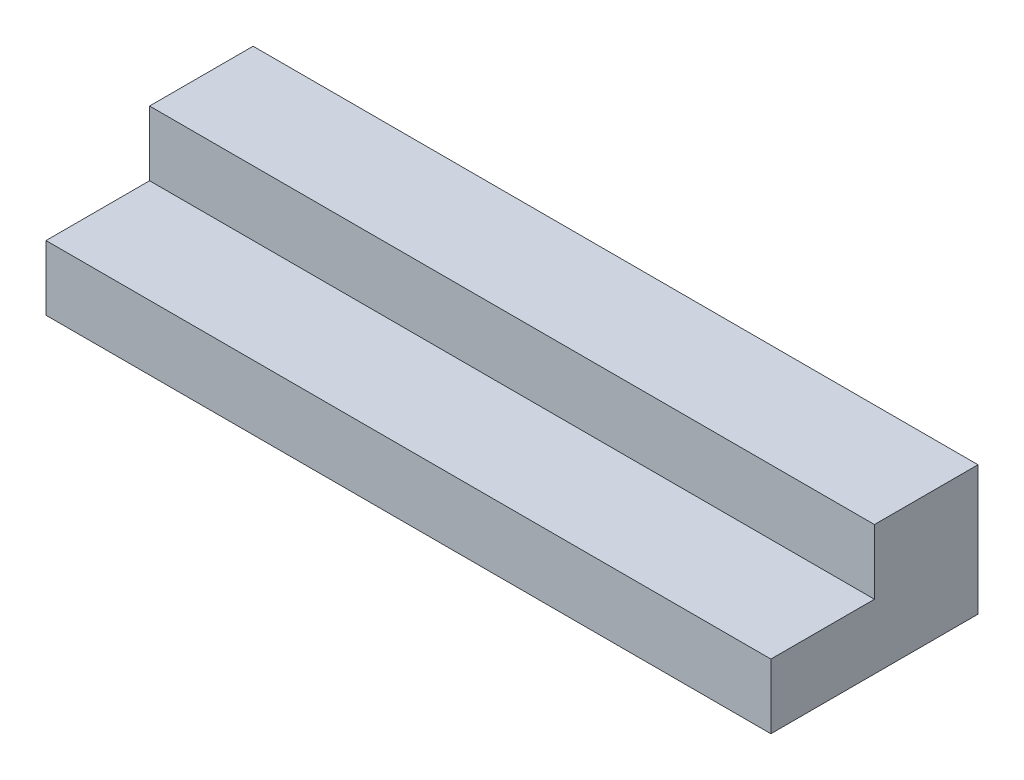
ISO-10303-21;
HEADER;
FILE_DESCRIPTION(('STEP AP214'),'2;1');
FILE_NAME('part.step','',(''),(''),'','','');
FILE_SCHEMA(('AUTOMOTIVE_DESIGN { 1 0 10303 214 1 1 1 1 }'));
ENDSEC;
DATA;
#1=APPLICATION_CONTEXT('core data for automotive mechanical design processes');
#2=APPLICATION_PROTOCOL_DEFINITION('international standard','automotive_design',2000,#1);
#3=PRODUCT_CONTEXT('',#1,'mechanical');
#4=PRODUCT('Part','Part','',(#3));
#5=PRODUCT_RELATED_PRODUCT_CATEGORY('part','',(#4));
#6=PRODUCT_DEFINITION_FORMATION('','',#4);
#7=PRODUCT_DEFINITION_CONTEXT('part definition',#1,'design');
#8=PRODUCT_DEFINITION('design','',#6,#7);
#9=PRODUCT_DEFINITION_SHAPE('','',#8);
#10=(LENGTH_UNIT() NAMED_UNIT(*) SI_UNIT(.MILLI.,.METRE.));
#11=(NAMED_UNIT(*) PLANE_ANGLE_UNIT() SI_UNIT($,.RADIAN.));
#12=(NAMED_UNIT(*) SI_UNIT($,.STERADIAN.) SOLID_ANGLE_UNIT());
#13=UNCERTAINTY_MEASURE_WITH_UNIT(LENGTH_MEASURE(1.E-05),#10,'distance_accuracy_value','');
#14=(GEOMETRIC_REPRESENTATION_CONTEXT(3) GLOBAL_UNCERTAINTY_ASSIGNED_CONTEXT((#13)) GLOBAL_UNIT_ASSIGNED_CONTEXT((#10,
#11,#12)) REPRESENTATION_CONTEXT('',''));
#15=CARTESIAN_POINT('',(0.,0.,0.));
#16=DIRECTION('',(0.,0.,1.));
#17=DIRECTION('',(1.,0.,0.));
#18=AXIS2_PLACEMENT_3D('',#15,#16,#17);
#19=CARTESIAN_POINT('',(1400.,136.656578684517,21.7053534125491));
#20=DIRECTION('',(0.,-1.,0.));
#21=DIRECTION('',(0.,0.,-1.));
#22=AXIS2_PLACEMENT_3D('',#19,#20,#21);
#23=PLANE('',#22);
#24=DIRECTION('',(0.,0.,1.));
#25=VECTOR('',#24,1.);
#26=CARTESIAN_POINT('',(0.,136.656578684517,21.7053534125491));
#27=LINE('',#26,#25);
#28=CARTESIAN_POINT('',(0.,136.656578684517,-178.294646587451));
#29=VERTEX_POINT('',#28);
#30=CARTESIAN_POINT('',(0.,136.656578684517,21.7053534125491));
#31=VERTEX_POINT('',#30);
#32=EDGE_CURVE('E118',#29,#31,#27,.T.);
#33=ORIENTED_EDGE('',*,*,#32,.T.);
#34=DIRECTION('',(-1.,0.,0.));
#35=VECTOR('',#34,1.);
#36=CARTESIAN_POINT('',(1400.,136.656578684517,21.7053534125491));
#37=LINE('',#36,#35);
#38=CARTESIAN_POINT('',(1400.,136.656578684517,21.7053534125491));
#39=VERTEX_POINT('',#38);
#40=EDGE_CURVE('E11',#39,#31,#37,.T.);
#41=ORIENTED_EDGE('',*,*,#40,.F.);
#42=DIRECTION('',(0.,0.,1.));
#43=VECTOR('',#42,1.);
#44=CARTESIAN_POINT('',(1400.,136.656578684517,21.7053534125491));
#45=LINE('',#44,#43);
#46=CARTESIAN_POINT('',(1400.,136.656578684517,-178.294646587451));
#47=VERTEX_POINT('',#46);
#48=EDGE_CURVE('E128',#47,#39,#45,.T.);
#49=ORIENTED_EDGE('',*,*,#48,.F.);
#50=DIRECTION('',(-1.,0.,0.));
#51=VECTOR('',#50,1.);
#52=CARTESIAN_POINT('',(1400.,136.656578684517,-178.294646587451));
#53=LINE('',#52,#51);
#54=EDGE_CURVE('E114',#47,#29,#53,.T.);
#55=ORIENTED_EDGE('',*,*,#54,.T.);
#56=EDGE_LOOP('',(#33,#41,#49,#55));
#57=FACE_BOUND('',#56,.T.);
#58=ADVANCED_FACE('F34',(#57),#23,.F.);
#59=CARTESIAN_POINT('',(1400.,136.656578684517,21.7053534125491));
#60=DIRECTION('',(0.,0.,-1.));
#61=DIRECTION('',(0.,1.,0.));
#62=AXIS2_PLACEMENT_3D('',#59,#60,#61);
#63=PLANE('',#62);
#64=DIRECTION('',(0.,-1.,0.));
#65=VECTOR('',#64,1.);
#66=CARTESIAN_POINT('',(0.,136.656578684517,21.7053534125491));
#67=LINE('',#66,#65);
#68=CARTESIAN_POINT('',(0.,11.6565786845171,21.7053534125491));
#69=VERTEX_POINT('',#68);
#70=EDGE_CURVE('E121',#31,#69,#67,.T.);
#71=ORIENTED_EDGE('',*,*,#70,.T.);
#72=DIRECTION('',(-1.,0.,0.));
#73=VECTOR('',#72,1.);
#74=CARTESIAN_POINT('',(1400.,11.6565786845171,21.7053534125491));
#75=LINE('',#74,#73);
#76=CARTESIAN_POINT('',(1400.,11.6565786845171,21.7053534125491));
#77=VERTEX_POINT('',#76);
#78=EDGE_CURVE('E42',#77,#69,#75,.T.);
#79=ORIENTED_EDGE('',*,*,#78,.F.);
#80=DIRECTION('',(0.,-1.,0.));
#81=VECTOR('',#80,1.);
#82=CARTESIAN_POINT('',(1400.,136.656578684517,21.7053534125491));
#83=LINE('',#82,#81);
#84=EDGE_CURVE('E87',#39,#77,#83,.T.);
#85=ORIENTED_EDGE('',*,*,#84,.F.);
#86=ORIENTED_EDGE('',*,*,#40,.T.);
#87=EDGE_LOOP('',(#71,#79,#85,#86));
#88=FACE_BOUND('',#87,.T.);
#89=ADVANCED_FACE('F152',(#88),#63,.F.);
#90=CARTESIAN_POINT('',(1400.,11.6565786845171,221.705353412549));
#91=DIRECTION('',(0.,-1.,0.));
#92=DIRECTION('',(0.,0.,-1.));
#93=AXIS2_PLACEMENT_3D('',#90,#91,#92);
#94=PLANE('',#93);
#95=DIRECTION('',(0.,0.,1.));
#96=VECTOR('',#95,1.);
#97=CARTESIAN_POINT('',(0.,11.6565786845171,221.705353412549));
#98=LINE('',#97,#96);
#99=CARTESIAN_POINT('',(0.,11.6565786845171,221.705353412549));
#100=VERTEX_POINT('',#99);
#101=EDGE_CURVE('E123',#69,#100,#98,.T.);
#102=ORIENTED_EDGE('',*,*,#101,.T.);
#103=DIRECTION('',(-1.,0.,0.));
#104=VECTOR('',#103,1.);
#105=CARTESIAN_POINT('',(1400.,11.6565786845171,221.705353412549));
#106=LINE('',#105,#104);
#107=CARTESIAN_POINT('',(1400.,11.6565786845171,221.705353412549));
#108=VERTEX_POINT('',#107);
#109=EDGE_CURVE('E109',#108,#100,#106,.T.);
#110=ORIENTED_EDGE('',*,*,#109,.F.);
#111=DIRECTION('',(0.,0.,1.));
#112=VECTOR('',#111,1.);
#113=CARTESIAN_POINT('',(1400.,11.6565786845171,221.705353412549));
#114=LINE('',#113,#112);
#115=EDGE_CURVE('E100',#77,#108,#114,.T.);
#116=ORIENTED_EDGE('',*,*,#115,.F.);
#117=ORIENTED_EDGE('',*,*,#78,.T.);
#118=EDGE_LOOP('',(#102,#110,#116,#117));
#119=FACE_BOUND('',#118,.T.);
#120=ADVANCED_FACE('F134',(#119),#94,.F.);
#121=CARTESIAN_POINT('',(1400.,-113.343421315483,221.705353412549));
#122=DIRECTION('',(0.,0.,-1.));
#123=DIRECTION('',(-1.,0.,0.));
#124=AXIS2_PLACEMENT_3D('',#121,#122,#123);
#125=PLANE('',#124);
#126=DIRECTION('',(0.,-1.,0.));
#127=VECTOR('',#126,1.);
#128=CARTESIAN_POINT('',(0.,-113.343421315483,221.705353412549));
#129=LINE('',#128,#127);
#130=CARTESIAN_POINT('',(0.,-113.343421315483,221.705353412549));
#131=VERTEX_POINT('',#130);
#132=EDGE_CURVE('E108',#100,#131,#129,.T.);
#133=ORIENTED_EDGE('',*,*,#132,.T.);
#134=DIRECTION('',(-1.,0.,0.));
#135=VECTOR('',#134,1.);
#136=CARTESIAN_POINT('',(1400.,-113.343421315483,221.705353412549));
#137=LINE('',#136,#135);
#138=CARTESIAN_POINT('',(1400.,-113.343421315483,221.705353412549));
#139=VERTEX_POINT('',#138);
#140=EDGE_CURVE('E105',#139,#131,#137,.T.);
#141=ORIENTED_EDGE('',*,*,#140,.F.);
#142=DIRECTION('',(0.,-1.,0.));
#143=VECTOR('',#142,1.);
#144=CARTESIAN_POINT('',(1400.,-113.343421315483,221.705353412549));
#145=LINE('',#144,#143);
#146=EDGE_CURVE('E94',#108,#139,#145,.T.);
#147=ORIENTED_EDGE('',*,*,#146,.F.);
#148=ORIENTED_EDGE('',*,*,#109,.T.);
#149=EDGE_LOOP('',(#133,#141,#147,#148));
#150=FACE_BOUND('',#149,.T.);
#151=ADVANCED_FACE('F106',(#150),#125,.F.);
#152=CARTESIAN_POINT('',(1400.,-113.343421315483,-178.294646587451));
#153=DIRECTION('',(0.,1.,0.));
#154=DIRECTION('',(0.,0.,1.));
#155=AXIS2_PLACEMENT_3D('',#152,#153,#154);
#156=PLANE('',#155);
#157=DIRECTION('',(0.,0.,-1.));
#158=VECTOR('',#157,1.);
#159=CARTESIAN_POINT('',(0.,-113.343421315483,-178.294646587451));
#160=LINE('',#159,#158);
#161=CARTESIAN_POINT('',(0.,-113.343421315483,-178.294646587451));
#162=VERTEX_POINT('',#161);
#163=EDGE_CURVE('E73',#131,#162,#160,.T.);
#164=ORIENTED_EDGE('',*,*,#163,.T.);
#165=DIRECTION('',(-1.,0.,0.));
#166=VECTOR('',#165,1.);
#167=CARTESIAN_POINT('',(1400.,-113.343421315483,-178.294646587451));
#168=LINE('',#167,#166);
#169=CARTESIAN_POINT('',(1400.,-113.343421315483,-178.294646587451));
#170=VERTEX_POINT('',#169);
#171=EDGE_CURVE('E110',#170,#162,#168,.T.);
#172=ORIENTED_EDGE('',*,*,#171,.F.);
#173=DIRECTION('',(0.,0.,-1.));
#174=VECTOR('',#173,1.);
#175=CARTESIAN_POINT('',(1400.,-113.343421315483,-178.294646587451));
#176=LINE('',#175,#174);
#177=EDGE_CURVE('E98',#139,#170,#176,.T.);
#178=ORIENTED_EDGE('',*,*,#177,.F.);
#179=ORIENTED_EDGE('',*,*,#140,.T.);
#180=EDGE_LOOP('',(#164,#172,#178,#179));
#181=FACE_BOUND('',#180,.T.);
#182=ADVANCED_FACE('F112',(#181),#156,.F.);
#183=CARTESIAN_POINT('',(1400.,136.656578684517,-178.294646587451));
#184=DIRECTION('',(0.,0.,1.));
#185=DIRECTION('',(1.,0.,0.));
#186=AXIS2_PLACEMENT_3D('',#183,#184,#185);
#187=PLANE('',#186);
#188=DIRECTION('',(0.,1.,0.));
#189=VECTOR('',#188,1.);
#190=CARTESIAN_POINT('',(0.,136.656578684517,-178.294646587451));
#191=LINE('',#190,#189);
#192=EDGE_CURVE('E79',#162,#29,#191,.T.);
#193=ORIENTED_EDGE('',*,*,#192,.T.);
#194=ORIENTED_EDGE('',*,*,#54,.F.);
#195=DIRECTION('',(0.,1.,0.));
#196=VECTOR('',#195,1.);
#197=CARTESIAN_POINT('',(1400.,136.656578684517,-178.294646587451));
#198=LINE('',#197,#196);
#199=EDGE_CURVE('E50',#170,#47,#198,.T.);
#200=ORIENTED_EDGE('',*,*,#199,.F.);
#201=ORIENTED_EDGE('',*,*,#171,.T.);
#202=EDGE_LOOP('',(#193,#194,#200,#201));
#203=FACE_BOUND('',#202,.T.);
#204=ADVANCED_FACE('F141',(#203),#187,.F.);
#205=CARTESIAN_POINT('',(1400.,0.,0.));
#206=DIRECTION('',(-1.,0.,0.));
#207=DIRECTION('',(0.,0.,1.));
#208=AXIS2_PLACEMENT_3D('',#205,#206,#207);
#209=PLANE('',#208);
#210=ORIENTED_EDGE('',*,*,#48,.T.);
#211=ORIENTED_EDGE('',*,*,#84,.T.);
#212=ORIENTED_EDGE('',*,*,#115,.T.);
#213=ORIENTED_EDGE('',*,*,#146,.T.);
#214=ORIENTED_EDGE('',*,*,#177,.T.);
#215=ORIENTED_EDGE('',*,*,#199,.T.);
#216=EDGE_LOOP('',(#210,#211,#212,#213,#214,#215));
#217=FACE_BOUND('',#216,.T.);
#218=ADVANCED_FACE('F96',(#217),#209,.F.);
#219=CARTESIAN_POINT('',(0.,0.,0.));
#220=DIRECTION('',(-1.,0.,0.));
#221=DIRECTION('',(0.,0.,1.));
#222=AXIS2_PLACEMENT_3D('',#219,#220,#221);
#223=PLANE('',#222);
#224=ORIENTED_EDGE('',*,*,#32,.F.);
#225=ORIENTED_EDGE('',*,*,#192,.F.);
#226=ORIENTED_EDGE('',*,*,#163,.F.);
#227=ORIENTED_EDGE('',*,*,#132,.F.);
#228=ORIENTED_EDGE('',*,*,#101,.F.);
#229=ORIENTED_EDGE('',*,*,#70,.F.);
#230=EDGE_LOOP('',(#224,#225,#226,#227,#228,#229));
#231=FACE_BOUND('',#230,.T.);
#232=ADVANCED_FACE('F137',(#231),#223,.T.);
#233=CLOSED_SHELL('',(#58,#89,#120,#151,#182,#204,#218,#232));
#234=MANIFOLD_SOLID_BREP('B2',#233);
#235=ADVANCED_BREP_SHAPE_REPRESENTATION('',(#18,#234),#14);
#236=SHAPE_DEFINITION_REPRESENTATION(#9,#235);
ENDSEC;
END-ISO-10303-21;
